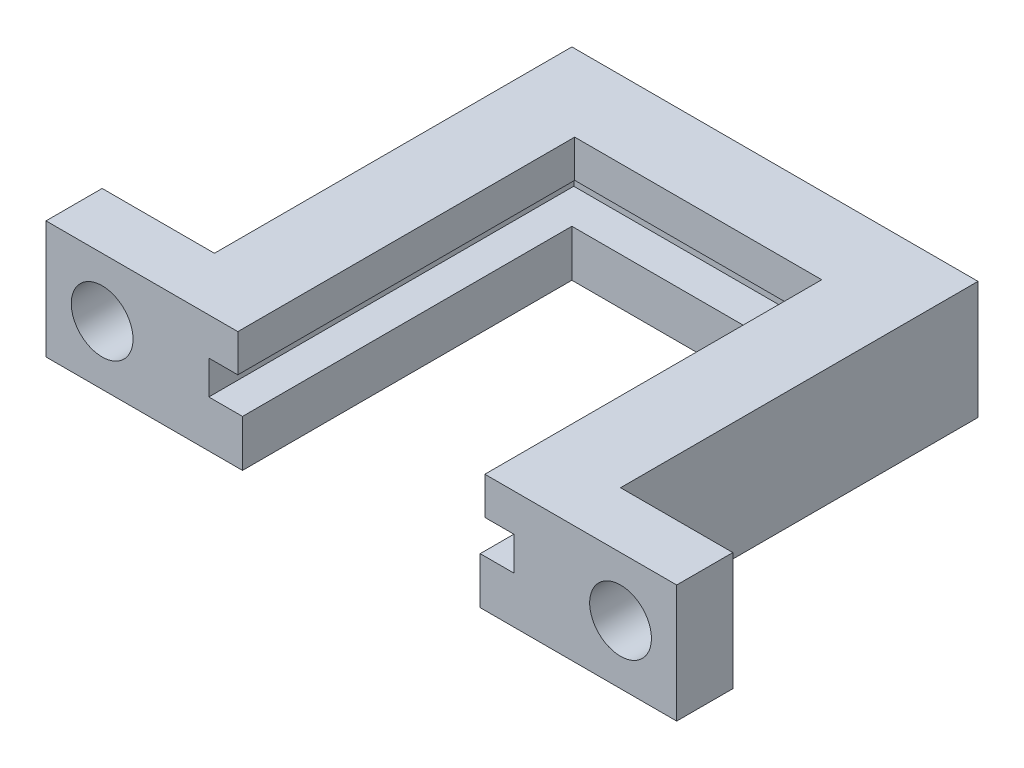
ISO-10303-21;
HEADER;
FILE_DESCRIPTION(('STEP AP214'),'2;1');
FILE_NAME('part.step','',(''),(''),'','','');
FILE_SCHEMA(('AUTOMOTIVE_DESIGN { 1 0 10303 214 1 1 1 1 }'));
ENDSEC;
DATA;
#1=APPLICATION_CONTEXT('core data for automotive mechanical design processes');
#2=APPLICATION_PROTOCOL_DEFINITION('international standard','automotive_design',2000,#1);
#3=PRODUCT_CONTEXT('',#1,'mechanical');
#4=PRODUCT('Part','Part','',(#3));
#5=PRODUCT_RELATED_PRODUCT_CATEGORY('part','',(#4));
#6=PRODUCT_DEFINITION_FORMATION('','',#4);
#7=PRODUCT_DEFINITION_CONTEXT('part definition',#1,'design');
#8=PRODUCT_DEFINITION('design','',#6,#7);
#9=PRODUCT_DEFINITION_SHAPE('','',#8);
#10=(LENGTH_UNIT() NAMED_UNIT(*) SI_UNIT(.MILLI.,.METRE.));
#11=(NAMED_UNIT(*) PLANE_ANGLE_UNIT() SI_UNIT($,.RADIAN.));
#12=(NAMED_UNIT(*) SI_UNIT($,.STERADIAN.) SOLID_ANGLE_UNIT());
#13=UNCERTAINTY_MEASURE_WITH_UNIT(LENGTH_MEASURE(1.E-05),#10,'distance_accuracy_value','');
#14=(GEOMETRIC_REPRESENTATION_CONTEXT(3) GLOBAL_UNCERTAINTY_ASSIGNED_CONTEXT((#13)) GLOBAL_UNIT_ASSIGNED_CONTEXT((#10,
#11,#12)) REPRESENTATION_CONTEXT('',''));
#15=CARTESIAN_POINT('',(0.,0.,0.));
#16=DIRECTION('',(0.,0.,1.));
#17=DIRECTION('',(1.,0.,0.));
#18=AXIS2_PLACEMENT_3D('',#15,#16,#17);
#19=CARTESIAN_POINT('',(0.,2.5,0.));
#20=DIRECTION('',(0.,-1.,0.));
#21=DIRECTION('',(0.,0.,-1.));
#22=AXIS2_PLACEMENT_3D('',#19,#20,#21);
#23=PLANE('',#22);
#24=DIRECTION('',(0.,0.,1.));
#25=VECTOR('',#24,1.);
#26=CARTESIAN_POINT('',(19.,2.5,0.));
#27=LINE('',#26,#25);
#28=CARTESIAN_POINT('',(19.,2.5,-19.5));
#29=VERTEX_POINT('',#28);
#30=CARTESIAN_POINT('',(19.,2.5,0.));
#31=VERTEX_POINT('',#30);
#32=EDGE_CURVE('E276',#29,#31,#27,.T.);
#33=ORIENTED_EDGE('',*,*,#32,.F.);
#34=DIRECTION('',(1.,0.,0.));
#35=VECTOR('',#34,1.);
#36=CARTESIAN_POINT('',(19.,2.5,-19.5));
#37=LINE('',#36,#35);
#38=CARTESIAN_POINT('',(2.7,2.5,-19.5));
#39=VERTEX_POINT('',#38);
#40=EDGE_CURVE('E285',#39,#29,#37,.T.);
#41=ORIENTED_EDGE('',*,*,#40,.F.);
#42=DIRECTION('',(0.,0.,-1.));
#43=VECTOR('',#42,1.);
#44=CARTESIAN_POINT('',(2.7,2.5,-19.5));
#45=LINE('',#44,#43);
#46=CARTESIAN_POINT('',(2.7,2.5,0.));
#47=VERTEX_POINT('',#46);
#48=EDGE_CURVE('E271',#47,#39,#45,.T.);
#49=ORIENTED_EDGE('',*,*,#48,.F.);
#50=DIRECTION('',(1.,0.,0.));
#51=VECTOR('',#50,1.);
#52=CARTESIAN_POINT('',(4.5,2.5,0.));
#53=LINE('',#52,#51);
#54=CARTESIAN_POINT('',(4.5,2.5,0.));
#55=VERTEX_POINT('',#54);
#56=EDGE_CURVE('E302',#47,#55,#53,.T.);
#57=ORIENTED_EDGE('',*,*,#56,.T.);
#58=DIRECTION('',(0.,0.,-1.));
#59=VECTOR('',#58,1.);
#60=CARTESIAN_POINT('',(4.5,2.5,-17.6));
#61=LINE('',#60,#59);
#62=CARTESIAN_POINT('',(4.5,2.5,-17.6));
#63=VERTEX_POINT('',#62);
#64=EDGE_CURVE('E304',#55,#63,#61,.T.);
#65=ORIENTED_EDGE('',*,*,#64,.T.);
#66=DIRECTION('',(1.,0.,0.));
#67=VECTOR('',#66,1.);
#68=CARTESIAN_POINT('',(17.2,2.5,-17.6));
#69=LINE('',#68,#67);
#70=CARTESIAN_POINT('',(17.2,2.5,-17.6));
#71=VERTEX_POINT('',#70);
#72=EDGE_CURVE('E307',#63,#71,#69,.T.);
#73=ORIENTED_EDGE('',*,*,#72,.T.);
#74=DIRECTION('',(0.,0.,1.));
#75=VECTOR('',#74,1.);
#76=CARTESIAN_POINT('',(17.2,2.5,0.));
#77=LINE('',#76,#75);
#78=CARTESIAN_POINT('',(17.2,2.5,0.));
#79=VERTEX_POINT('',#78);
#80=EDGE_CURVE('E309',#71,#79,#77,.T.);
#81=ORIENTED_EDGE('',*,*,#80,.T.);
#82=DIRECTION('',(1.,0.,0.));
#83=VECTOR('',#82,1.);
#84=CARTESIAN_POINT('',(21.7,2.5,0.));
#85=LINE('',#84,#83);
#86=EDGE_CURVE('E311',#79,#31,#85,.T.);
#87=ORIENTED_EDGE('',*,*,#86,.T.);
#88=EDGE_LOOP('',(#33,#41,#49,#57,#65,#73,#81,#87));
#89=FACE_BOUND('',#88,.T.);
#90=ADVANCED_FACE('F37',(#89),#23,.F.);
#91=CARTESIAN_POINT('',(4.5,2.5,0.));
#92=DIRECTION('',(0.,0.,-1.));
#93=DIRECTION('',(-1.,0.,0.));
#94=AXIS2_PLACEMENT_3D('',#91,#92,#93);
#95=PLANE('',#94);
#96=DIRECTION('',(1.,0.,0.));
#97=VECTOR('',#96,1.);
#98=CARTESIAN_POINT('',(4.5,0.,0.));
#99=LINE('',#98,#97);
#100=CARTESIAN_POINT('',(-6.,0.,0.));
#101=VERTEX_POINT('',#100);
#102=CARTESIAN_POINT('',(4.5,0.,0.));
#103=VERTEX_POINT('',#102);
#104=EDGE_CURVE('E301',#101,#103,#99,.T.);
#105=ORIENTED_EDGE('',*,*,#104,.T.);
#106=DIRECTION('',(0.,-1.,0.));
#107=VECTOR('',#106,1.);
#108=CARTESIAN_POINT('',(4.5,2.5,0.));
#109=LINE('',#108,#107);
#110=EDGE_CURVE('E11',#55,#103,#109,.T.);
#111=ORIENTED_EDGE('',*,*,#110,.F.);
#112=ORIENTED_EDGE('',*,*,#56,.F.);
#113=DIRECTION('',(0.,-1.,0.));
#114=VECTOR('',#113,1.);
#115=CARTESIAN_POINT('',(2.7,4.3,0.));
#116=LINE('',#115,#114);
#117=CARTESIAN_POINT('',(2.7,4.3,0.));
#118=VERTEX_POINT('',#117);
#119=EDGE_CURVE('E298',#118,#47,#116,.T.);
#120=ORIENTED_EDGE('',*,*,#119,.F.);
#121=DIRECTION('',(1.,0.,0.));
#122=VECTOR('',#121,1.);
#123=CARTESIAN_POINT('',(4.25,4.3,0.));
#124=LINE('',#123,#122);
#125=CARTESIAN_POINT('',(4.25,4.3,0.));
#126=VERTEX_POINT('',#125);
#127=EDGE_CURVE('E227',#118,#126,#124,.T.);
#128=ORIENTED_EDGE('',*,*,#127,.T.);
#129=DIRECTION('',(0.,-1.,0.));
#130=VECTOR('',#129,1.);
#131=CARTESIAN_POINT('',(4.25,6.3,0.));
#132=LINE('',#131,#130);
#133=CARTESIAN_POINT('',(4.25,6.3,0.));
#134=VERTEX_POINT('',#133);
#135=EDGE_CURVE('E268',#134,#126,#132,.T.);
#136=ORIENTED_EDGE('',*,*,#135,.F.);
#137=DIRECTION('',(1.,0.,0.));
#138=VECTOR('',#137,1.);
#139=CARTESIAN_POINT('',(4.25,6.3,0.));
#140=LINE('',#139,#138);
#141=CARTESIAN_POINT('',(-6.,6.3,0.));
#142=VERTEX_POINT('',#141);
#143=EDGE_CURVE('E230',#142,#134,#140,.T.);
#144=ORIENTED_EDGE('',*,*,#143,.F.);
#145=DIRECTION('',(0.,-1.,0.));
#146=VECTOR('',#145,1.);
#147=CARTESIAN_POINT('',(-6.,0.,0.));
#148=LINE('',#147,#146);
#149=EDGE_CURVE('E209',#142,#101,#148,.T.);
#150=ORIENTED_EDGE('',*,*,#149,.T.);
#151=EDGE_LOOP('',(#105,#111,#112,#120,#128,#136,#144,#150));
#152=FACE_BOUND('',#151,.T.);
#153=CARTESIAN_POINT('',(-3.,3.15,0.));
#154=DIRECTION('',(0.,0.,1.));
#155=DIRECTION('',(1.,0.,0.));
#156=AXIS2_PLACEMENT_3D('',#153,#154,#155);
#157=CIRCLE('',#156,1.65);
#158=CARTESIAN_POINT('',(-1.35,3.15,0.));
#159=VERTEX_POINT('',#158);
#160=EDGE_CURVE('E204',#159,#159,#157,.T.);
#161=ORIENTED_EDGE('',*,*,#160,.F.);
#162=EDGE_LOOP('',(#161));
#163=FACE_BOUND('',#162,.T.);
#164=ADVANCED_FACE('F39',(#152,#163),#95,.F.);
#165=CARTESIAN_POINT('',(4.5,2.5,-17.6));
#166=DIRECTION('',(-1.,0.,0.));
#167=DIRECTION('',(0.,0.,1.));
#168=AXIS2_PLACEMENT_3D('',#165,#166,#167);
#169=PLANE('',#168);
#170=DIRECTION('',(0.,0.,-1.));
#171=VECTOR('',#170,1.);
#172=CARTESIAN_POINT('',(4.5,0.,-17.6));
#173=LINE('',#172,#171);
#174=CARTESIAN_POINT('',(4.5,0.,-17.6));
#175=VERTEX_POINT('',#174);
#176=EDGE_CURVE('E316',#103,#175,#173,.T.);
#177=ORIENTED_EDGE('',*,*,#176,.T.);
#178=DIRECTION('',(0.,-1.,0.));
#179=VECTOR('',#178,1.);
#180=CARTESIAN_POINT('',(4.5,2.5,-17.6));
#181=LINE('',#180,#179);
#182=EDGE_CURVE('E45',#63,#175,#181,.T.);
#183=ORIENTED_EDGE('',*,*,#182,.F.);
#184=ORIENTED_EDGE('',*,*,#64,.F.);
#185=ORIENTED_EDGE('',*,*,#110,.T.);
#186=EDGE_LOOP('',(#177,#183,#184,#185));
#187=FACE_BOUND('',#186,.T.);
#188=ADVANCED_FACE('F388',(#187),#169,.F.);
#189=CARTESIAN_POINT('',(17.2,2.5,-17.6));
#190=DIRECTION('',(0.,0.,-1.));
#191=DIRECTION('',(-1.,0.,0.));
#192=AXIS2_PLACEMENT_3D('',#189,#190,#191);
#193=PLANE('',#192);
#194=DIRECTION('',(1.,0.,0.));
#195=VECTOR('',#194,1.);
#196=CARTESIAN_POINT('',(17.2,0.,-17.6));
#197=LINE('',#196,#195);
#198=CARTESIAN_POINT('',(17.2,0.,-17.6));
#199=VERTEX_POINT('',#198);
#200=EDGE_CURVE('E318',#175,#199,#197,.T.);
#201=ORIENTED_EDGE('',*,*,#200,.T.);
#202=DIRECTION('',(0.,-1.,0.));
#203=VECTOR('',#202,1.);
#204=CARTESIAN_POINT('',(17.2,2.5,-17.6));
#205=LINE('',#204,#203);
#206=EDGE_CURVE('E337',#71,#199,#205,.T.);
#207=ORIENTED_EDGE('',*,*,#206,.F.);
#208=ORIENTED_EDGE('',*,*,#72,.F.);
#209=ORIENTED_EDGE('',*,*,#182,.T.);
#210=EDGE_LOOP('',(#201,#207,#208,#209));
#211=FACE_BOUND('',#210,.T.);
#212=ADVANCED_FACE('F344',(#211),#193,.F.);
#213=CARTESIAN_POINT('',(17.2,2.5,0.));
#214=DIRECTION('',(1.,0.,0.));
#215=DIRECTION('',(0.,0.,-1.));
#216=AXIS2_PLACEMENT_3D('',#213,#214,#215);
#217=PLANE('',#216);
#218=DIRECTION('',(0.,0.,1.));
#219=VECTOR('',#218,1.);
#220=CARTESIAN_POINT('',(17.2,0.,0.));
#221=LINE('',#220,#219);
#222=CARTESIAN_POINT('',(17.2,0.,0.));
#223=VERTEX_POINT('',#222);
#224=EDGE_CURVE('E320',#199,#223,#221,.T.);
#225=ORIENTED_EDGE('',*,*,#224,.T.);
#226=DIRECTION('',(0.,-1.,0.));
#227=VECTOR('',#226,1.);
#228=CARTESIAN_POINT('',(17.2,2.5,0.));
#229=LINE('',#228,#227);
#230=EDGE_CURVE('E334',#79,#223,#229,.T.);
#231=ORIENTED_EDGE('',*,*,#230,.F.);
#232=ORIENTED_EDGE('',*,*,#80,.F.);
#233=ORIENTED_EDGE('',*,*,#206,.T.);
#234=EDGE_LOOP('',(#225,#231,#232,#233));
#235=FACE_BOUND('',#234,.T.);
#236=ADVANCED_FACE('F351',(#235),#217,.F.);
#237=CARTESIAN_POINT('',(21.7,2.5,0.));
#238=DIRECTION('',(0.,0.,-1.));
#239=DIRECTION('',(-1.,0.,0.));
#240=AXIS2_PLACEMENT_3D('',#237,#238,#239);
#241=PLANE('',#240);
#242=DIRECTION('',(1.,0.,0.));
#243=VECTOR('',#242,1.);
#244=CARTESIAN_POINT('',(21.7,0.,0.));
#245=LINE('',#244,#243);
#246=CARTESIAN_POINT('',(27.7,0.,0.));
#247=VERTEX_POINT('',#246);
#248=EDGE_CURVE('E322',#223,#247,#245,.T.);
#249=ORIENTED_EDGE('',*,*,#248,.T.);
#250=DIRECTION('',(0.,1.,0.));
#251=VECTOR('',#250,1.);
#252=CARTESIAN_POINT('',(27.7,0.,0.));
#253=LINE('',#252,#251);
#254=CARTESIAN_POINT('',(27.7,6.3,0.));
#255=VERTEX_POINT('',#254);
#256=EDGE_CURVE('E183',#247,#255,#253,.T.);
#257=ORIENTED_EDGE('',*,*,#256,.T.);
#258=DIRECTION('',(1.,0.,0.));
#259=VECTOR('',#258,1.);
#260=CARTESIAN_POINT('',(21.7,6.3,0.));
#261=LINE('',#260,#259);
#262=CARTESIAN_POINT('',(17.45,6.3,0.));
#263=VERTEX_POINT('',#262);
#264=EDGE_CURVE('E240',#263,#255,#261,.T.);
#265=ORIENTED_EDGE('',*,*,#264,.F.);
#266=DIRECTION('',(0.,-1.,0.));
#267=VECTOR('',#266,1.);
#268=CARTESIAN_POINT('',(17.45,6.3,0.));
#269=LINE('',#268,#267);
#270=CARTESIAN_POINT('',(17.45,4.3,0.));
#271=VERTEX_POINT('',#270);
#272=EDGE_CURVE('E250',#263,#271,#269,.T.);
#273=ORIENTED_EDGE('',*,*,#272,.T.);
#274=DIRECTION('',(1.,0.,0.));
#275=VECTOR('',#274,1.);
#276=CARTESIAN_POINT('',(21.7,4.3,0.));
#277=LINE('',#276,#275);
#278=CARTESIAN_POINT('',(19.,4.3,0.));
#279=VERTEX_POINT('',#278);
#280=EDGE_CURVE('E234',#271,#279,#277,.T.);
#281=ORIENTED_EDGE('',*,*,#280,.T.);
#282=DIRECTION('',(0.,-1.,0.));
#283=VECTOR('',#282,1.);
#284=CARTESIAN_POINT('',(19.,4.3,0.));
#285=LINE('',#284,#283);
#286=EDGE_CURVE('E282',#279,#31,#285,.T.);
#287=ORIENTED_EDGE('',*,*,#286,.T.);
#288=ORIENTED_EDGE('',*,*,#86,.F.);
#289=ORIENTED_EDGE('',*,*,#230,.T.);
#290=EDGE_LOOP('',(#249,#257,#265,#273,#281,#287,#288,#289));
#291=FACE_BOUND('',#290,.T.);
#292=CARTESIAN_POINT('',(24.7,3.15,0.));
#293=DIRECTION('',(0.,0.,1.));
#294=DIRECTION('',(1.,0.,0.));
#295=AXIS2_PLACEMENT_3D('',#292,#293,#294);
#296=CIRCLE('',#295,1.65);
#297=CARTESIAN_POINT('',(26.35,3.15,0.));
#298=VERTEX_POINT('',#297);
#299=EDGE_CURVE('E592',#298,#298,#296,.T.);
#300=ORIENTED_EDGE('',*,*,#299,.F.);
#301=EDGE_LOOP('',(#300));
#302=FACE_BOUND('',#301,.T.);
#303=ADVANCED_FACE('F355',(#291,#302),#241,.F.);
#304=CARTESIAN_POINT('',(21.7,2.5,-22.1));
#305=DIRECTION('',(-1.,0.,0.));
#306=DIRECTION('',(0.,0.,1.));
#307=AXIS2_PLACEMENT_3D('',#304,#305,#306);
#308=PLANE('',#307);
#309=DIRECTION('',(0.,0.,-1.));
#310=VECTOR('',#309,1.);
#311=CARTESIAN_POINT('',(21.7,6.3,-22.1));
#312=LINE('',#311,#310);
#313=CARTESIAN_POINT('',(21.7,6.3,-3.));
#314=VERTEX_POINT('',#313);
#315=CARTESIAN_POINT('',(21.7,6.3,-22.1));
#316=VERTEX_POINT('',#315);
#317=EDGE_CURVE('E242',#314,#316,#312,.T.);
#318=ORIENTED_EDGE('',*,*,#317,.F.);
#319=DIRECTION('',(0.,-1.,0.));
#320=VECTOR('',#319,1.);
#321=CARTESIAN_POINT('',(21.7,0.,-3.));
#322=LINE('',#321,#320);
#323=CARTESIAN_POINT('',(21.7,0.,-3.));
#324=VERTEX_POINT('',#323);
#325=EDGE_CURVE('E196',#314,#324,#322,.T.);
#326=ORIENTED_EDGE('',*,*,#325,.T.);
#327=DIRECTION('',(0.,0.,-1.));
#328=VECTOR('',#327,1.);
#329=CARTESIAN_POINT('',(21.7,0.,-22.1));
#330=LINE('',#329,#328);
#331=CARTESIAN_POINT('',(21.7,0.,-22.1));
#332=VERTEX_POINT('',#331);
#333=EDGE_CURVE('E195',#324,#332,#330,.T.);
#334=ORIENTED_EDGE('',*,*,#333,.T.);
#335=DIRECTION('',(0.,-1.,0.));
#336=VECTOR('',#335,1.);
#337=CARTESIAN_POINT('',(21.7,2.5,-22.1));
#338=LINE('',#337,#336);
#339=EDGE_CURVE('E331',#316,#332,#338,.T.);
#340=ORIENTED_EDGE('',*,*,#339,.F.);
#341=EDGE_LOOP('',(#318,#326,#334,#340));
#342=FACE_BOUND('',#341,.T.);
#343=ADVANCED_FACE('F412',(#342),#308,.F.);
#344=CARTESIAN_POINT('',(0.,2.5,-22.1));
#345=DIRECTION('',(0.,0.,1.));
#346=DIRECTION('',(1.,0.,0.));
#347=AXIS2_PLACEMENT_3D('',#344,#345,#346);
#348=PLANE('',#347);
#349=DIRECTION('',(-1.,0.,0.));
#350=VECTOR('',#349,1.);
#351=CARTESIAN_POINT('',(0.,0.,-22.1));
#352=LINE('',#351,#350);
#353=CARTESIAN_POINT('',(0.,0.,-22.1));
#354=VERTEX_POINT('',#353);
#355=EDGE_CURVE('E325',#332,#354,#352,.T.);
#356=ORIENTED_EDGE('',*,*,#355,.T.);
#357=DIRECTION('',(0.,-1.,0.));
#358=VECTOR('',#357,1.);
#359=CARTESIAN_POINT('',(0.,2.5,-22.1));
#360=LINE('',#359,#358);
#361=CARTESIAN_POINT('',(0.,6.3,-22.1));
#362=VERTEX_POINT('',#361);
#363=EDGE_CURVE('E313',#362,#354,#360,.T.);
#364=ORIENTED_EDGE('',*,*,#363,.F.);
#365=DIRECTION('',(-1.,0.,0.));
#366=VECTOR('',#365,1.);
#367=CARTESIAN_POINT('',(0.,6.3,-22.1));
#368=LINE('',#367,#366);
#369=EDGE_CURVE('E244',#316,#362,#368,.T.);
#370=ORIENTED_EDGE('',*,*,#369,.F.);
#371=ORIENTED_EDGE('',*,*,#339,.T.);
#372=EDGE_LOOP('',(#356,#364,#370,#371));
#373=FACE_BOUND('',#372,.T.);
#374=ADVANCED_FACE('F409',(#373),#348,.F.);
#375=CARTESIAN_POINT('',(0.,2.5,0.));
#376=DIRECTION('',(1.,0.,0.));
#377=DIRECTION('',(0.,0.,-1.));
#378=AXIS2_PLACEMENT_3D('',#375,#376,#377);
#379=PLANE('',#378);
#380=DIRECTION('',(0.,0.,1.));
#381=VECTOR('',#380,1.);
#382=CARTESIAN_POINT('',(0.,0.,0.));
#383=LINE('',#382,#381);
#384=CARTESIAN_POINT('',(0.,0.,-3.));
#385=VERTEX_POINT('',#384);
#386=EDGE_CURVE('E305',#354,#385,#383,.T.);
#387=ORIENTED_EDGE('',*,*,#386,.T.);
#388=DIRECTION('',(0.,1.,0.));
#389=VECTOR('',#388,1.);
#390=CARTESIAN_POINT('',(0.,0.,-3.));
#391=LINE('',#390,#389);
#392=CARTESIAN_POINT('',(0.,6.3,-3.));
#393=VERTEX_POINT('',#392);
#394=EDGE_CURVE('E212',#385,#393,#391,.T.);
#395=ORIENTED_EDGE('',*,*,#394,.T.);
#396=DIRECTION('',(0.,0.,1.));
#397=VECTOR('',#396,1.);
#398=CARTESIAN_POINT('',(0.,6.3,0.));
#399=LINE('',#398,#397);
#400=EDGE_CURVE('E247',#362,#393,#399,.T.);
#401=ORIENTED_EDGE('',*,*,#400,.F.);
#402=ORIENTED_EDGE('',*,*,#363,.T.);
#403=EDGE_LOOP('',(#387,#395,#401,#402));
#404=FACE_BOUND('',#403,.T.);
#405=ADVANCED_FACE('F406',(#404),#379,.F.);
#406=CARTESIAN_POINT('',(0.,0.,0.));
#407=DIRECTION('',(0.,-1.,0.));
#408=DIRECTION('',(0.,0.,-1.));
#409=AXIS2_PLACEMENT_3D('',#406,#407,#408);
#410=PLANE('',#409);
#411=ORIENTED_EDGE('',*,*,#104,.F.);
#412=DIRECTION('',(0.,0.,1.));
#413=VECTOR('',#412,1.);
#414=CARTESIAN_POINT('',(-6.,0.,-3.));
#415=LINE('',#414,#413);
#416=CARTESIAN_POINT('',(-6.,0.,-3.));
#417=VERTEX_POINT('',#416);
#418=EDGE_CURVE('E224',#417,#101,#415,.T.);
#419=ORIENTED_EDGE('',*,*,#418,.F.);
#420=DIRECTION('',(1.,0.,0.));
#421=VECTOR('',#420,1.);
#422=CARTESIAN_POINT('',(0.,0.,-3.));
#423=LINE('',#422,#421);
#424=EDGE_CURVE('E218',#417,#385,#423,.T.);
#425=ORIENTED_EDGE('',*,*,#424,.T.);
#426=ORIENTED_EDGE('',*,*,#386,.F.);
#427=ORIENTED_EDGE('',*,*,#355,.F.);
#428=ORIENTED_EDGE('',*,*,#333,.F.);
#429=DIRECTION('',(1.,0.,0.));
#430=VECTOR('',#429,1.);
#431=CARTESIAN_POINT('',(21.7,0.,-3.));
#432=LINE('',#431,#430);
#433=CARTESIAN_POINT('',(27.7,0.,-3.));
#434=VERTEX_POINT('',#433);
#435=EDGE_CURVE('E52',#324,#434,#432,.T.);
#436=ORIENTED_EDGE('',*,*,#435,.T.);
#437=DIRECTION('',(0.,0.,1.));
#438=VECTOR('',#437,1.);
#439=CARTESIAN_POINT('',(27.7,0.,-3.));
#440=LINE('',#439,#438);
#441=EDGE_CURVE('E177',#434,#247,#440,.T.);
#442=ORIENTED_EDGE('',*,*,#441,.T.);
#443=ORIENTED_EDGE('',*,*,#248,.F.);
#444=ORIENTED_EDGE('',*,*,#224,.F.);
#445=ORIENTED_EDGE('',*,*,#200,.F.);
#446=ORIENTED_EDGE('',*,*,#176,.F.);
#447=EDGE_LOOP('',(#411,#419,#425,#426,#427,#428,#436,#442,#443,#444,#445,#446));
#448=FACE_BOUND('',#447,.T.);
#449=ADVANCED_FACE('F193',(#448),#410,.T.);
#450=CARTESIAN_POINT('',(2.7,4.3,-19.5));
#451=DIRECTION('',(-1.,0.,0.));
#452=DIRECTION('',(0.,0.,1.));
#453=AXIS2_PLACEMENT_3D('',#450,#451,#452);
#454=PLANE('',#453);
#455=ORIENTED_EDGE('',*,*,#48,.T.);
#456=DIRECTION('',(0.,-1.,0.));
#457=VECTOR('',#456,1.);
#458=CARTESIAN_POINT('',(2.7,4.3,-19.5));
#459=LINE('',#458,#457);
#460=CARTESIAN_POINT('',(2.7,4.3,-19.5));
#461=VERTEX_POINT('',#460);
#462=EDGE_CURVE('E295',#461,#39,#459,.T.);
#463=ORIENTED_EDGE('',*,*,#462,.F.);
#464=DIRECTION('',(0.,0.,-1.));
#465=VECTOR('',#464,1.);
#466=CARTESIAN_POINT('',(2.7,4.3,-19.5));
#467=LINE('',#466,#465);
#468=EDGE_CURVE('E272',#118,#461,#467,.T.);
#469=ORIENTED_EDGE('',*,*,#468,.F.);
#470=ORIENTED_EDGE('',*,*,#119,.T.);
#471=EDGE_LOOP('',(#455,#463,#469,#470));
#472=FACE_BOUND('',#471,.T.);
#473=ADVANCED_FACE('F366',(#472),#454,.F.);
#474=CARTESIAN_POINT('',(19.,4.3,-19.5));
#475=DIRECTION('',(0.,0.,-1.));
#476=DIRECTION('',(-1.,0.,0.));
#477=AXIS2_PLACEMENT_3D('',#474,#475,#476);
#478=PLANE('',#477);
#479=ORIENTED_EDGE('',*,*,#40,.T.);
#480=DIRECTION('',(0.,-1.,0.));
#481=VECTOR('',#480,1.);
#482=CARTESIAN_POINT('',(19.,4.3,-19.5));
#483=LINE('',#482,#481);
#484=CARTESIAN_POINT('',(19.,4.3,-19.5));
#485=VERTEX_POINT('',#484);
#486=EDGE_CURVE('E292',#485,#29,#483,.T.);
#487=ORIENTED_EDGE('',*,*,#486,.F.);
#488=DIRECTION('',(1.,0.,0.));
#489=VECTOR('',#488,1.);
#490=CARTESIAN_POINT('',(19.,4.3,-19.5));
#491=LINE('',#490,#489);
#492=EDGE_CURVE('E275',#461,#485,#491,.T.);
#493=ORIENTED_EDGE('',*,*,#492,.F.);
#494=ORIENTED_EDGE('',*,*,#462,.T.);
#495=EDGE_LOOP('',(#479,#487,#493,#494));
#496=FACE_BOUND('',#495,.T.);
#497=ADVANCED_FACE('F363',(#496),#478,.F.);
#498=CARTESIAN_POINT('',(19.,4.3,0.));
#499=DIRECTION('',(1.,0.,0.));
#500=DIRECTION('',(0.,0.,-1.));
#501=AXIS2_PLACEMENT_3D('',#498,#499,#500);
#502=PLANE('',#501);
#503=ORIENTED_EDGE('',*,*,#32,.T.);
#504=ORIENTED_EDGE('',*,*,#286,.F.);
#505=DIRECTION('',(0.,0.,1.));
#506=VECTOR('',#505,1.);
#507=CARTESIAN_POINT('',(19.,4.3,0.));
#508=LINE('',#507,#506);
#509=EDGE_CURVE('E279',#485,#279,#508,.T.);
#510=ORIENTED_EDGE('',*,*,#509,.F.);
#511=ORIENTED_EDGE('',*,*,#486,.T.);
#512=EDGE_LOOP('',(#503,#504,#510,#511));
#513=FACE_BOUND('',#512,.T.);
#514=ADVANCED_FACE('F359',(#513),#502,.F.);
#515=CARTESIAN_POINT('',(4.25,6.3,-18.));
#516=DIRECTION('',(-1.,0.,0.));
#517=DIRECTION('',(0.,0.,1.));
#518=AXIS2_PLACEMENT_3D('',#515,#516,#517);
#519=PLANE('',#518);
#520=DIRECTION('',(0.,0.,-1.));
#521=VECTOR('',#520,1.);
#522=CARTESIAN_POINT('',(4.25,4.3,-18.));
#523=LINE('',#522,#521);
#524=CARTESIAN_POINT('',(4.25,4.3,-18.));
#525=VERTEX_POINT('',#524);
#526=EDGE_CURVE('E252',#126,#525,#523,.T.);
#527=ORIENTED_EDGE('',*,*,#526,.T.);
#528=DIRECTION('',(0.,-1.,0.));
#529=VECTOR('',#528,1.);
#530=CARTESIAN_POINT('',(4.25,6.3,-18.));
#531=LINE('',#530,#529);
#532=CARTESIAN_POINT('',(4.25,6.3,-18.));
#533=VERTEX_POINT('',#532);
#534=EDGE_CURVE('E265',#533,#525,#531,.T.);
#535=ORIENTED_EDGE('',*,*,#534,.F.);
#536=DIRECTION('',(0.,0.,-1.));
#537=VECTOR('',#536,1.);
#538=CARTESIAN_POINT('',(4.25,6.3,-18.));
#539=LINE('',#538,#537);
#540=EDGE_CURVE('E233',#134,#533,#539,.T.);
#541=ORIENTED_EDGE('',*,*,#540,.F.);
#542=ORIENTED_EDGE('',*,*,#135,.T.);
#543=EDGE_LOOP('',(#527,#535,#541,#542));
#544=FACE_BOUND('',#543,.T.);
#545=ADVANCED_FACE('F380',(#544),#519,.F.);
#546=CARTESIAN_POINT('',(17.45,6.3,-18.));
#547=DIRECTION('',(0.,0.,-1.));
#548=DIRECTION('',(-1.,0.,0.));
#549=AXIS2_PLACEMENT_3D('',#546,#547,#548);
#550=PLANE('',#549);
#551=DIRECTION('',(1.,0.,0.));
#552=VECTOR('',#551,1.);
#553=CARTESIAN_POINT('',(17.45,4.3,-18.));
#554=LINE('',#553,#552);
#555=CARTESIAN_POINT('',(17.45,4.3,-18.));
#556=VERTEX_POINT('',#555);
#557=EDGE_CURVE('E254',#525,#556,#554,.T.);
#558=ORIENTED_EDGE('',*,*,#557,.T.);
#559=DIRECTION('',(0.,-1.,0.));
#560=VECTOR('',#559,1.);
#561=CARTESIAN_POINT('',(17.45,6.3,-18.));
#562=LINE('',#561,#560);
#563=CARTESIAN_POINT('',(17.45,6.3,-18.));
#564=VERTEX_POINT('',#563);
#565=EDGE_CURVE('E262',#564,#556,#562,.T.);
#566=ORIENTED_EDGE('',*,*,#565,.F.);
#567=DIRECTION('',(1.,0.,0.));
#568=VECTOR('',#567,1.);
#569=CARTESIAN_POINT('',(17.45,6.3,-18.));
#570=LINE('',#569,#568);
#571=EDGE_CURVE('E236',#533,#564,#570,.T.);
#572=ORIENTED_EDGE('',*,*,#571,.F.);
#573=ORIENTED_EDGE('',*,*,#534,.T.);
#574=EDGE_LOOP('',(#558,#566,#572,#573));
#575=FACE_BOUND('',#574,.T.);
#576=ADVANCED_FACE('F499',(#575),#550,.F.);
#577=CARTESIAN_POINT('',(17.45,6.3,0.));
#578=DIRECTION('',(1.,0.,0.));
#579=DIRECTION('',(0.,0.,-1.));
#580=AXIS2_PLACEMENT_3D('',#577,#578,#579);
#581=PLANE('',#580);
#582=DIRECTION('',(0.,0.,1.));
#583=VECTOR('',#582,1.);
#584=CARTESIAN_POINT('',(17.45,4.3,0.));
#585=LINE('',#584,#583);
#586=EDGE_CURVE('E256',#556,#271,#585,.T.);
#587=ORIENTED_EDGE('',*,*,#586,.T.);
#588=ORIENTED_EDGE('',*,*,#272,.F.);
#589=DIRECTION('',(0.,0.,1.));
#590=VECTOR('',#589,1.);
#591=CARTESIAN_POINT('',(17.45,6.3,0.));
#592=LINE('',#591,#590);
#593=EDGE_CURVE('E238',#564,#263,#592,.T.);
#594=ORIENTED_EDGE('',*,*,#593,.F.);
#595=ORIENTED_EDGE('',*,*,#565,.T.);
#596=EDGE_LOOP('',(#587,#588,#594,#595));
#597=FACE_BOUND('',#596,.T.);
#598=ADVANCED_FACE('F506',(#597),#581,.F.);
#599=CARTESIAN_POINT('',(0.,6.3,0.));
#600=DIRECTION('',(0.,-1.,0.));
#601=DIRECTION('',(0.,0.,-1.));
#602=AXIS2_PLACEMENT_3D('',#599,#600,#601);
#603=PLANE('',#602);
#604=ORIENTED_EDGE('',*,*,#143,.T.);
#605=ORIENTED_EDGE('',*,*,#540,.T.);
#606=ORIENTED_EDGE('',*,*,#571,.T.);
#607=ORIENTED_EDGE('',*,*,#593,.T.);
#608=ORIENTED_EDGE('',*,*,#264,.T.);
#609=DIRECTION('',(0.,0.,1.));
#610=VECTOR('',#609,1.);
#611=CARTESIAN_POINT('',(27.7,6.3,-3.));
#612=LINE('',#611,#610);
#613=CARTESIAN_POINT('',(27.7,6.3,-3.));
#614=VERTEX_POINT('',#613);
#615=EDGE_CURVE('E186',#614,#255,#612,.T.);
#616=ORIENTED_EDGE('',*,*,#615,.F.);
#617=DIRECTION('',(-1.,0.,0.));
#618=VECTOR('',#617,1.);
#619=CARTESIAN_POINT('',(21.7,6.3,-3.));
#620=LINE('',#619,#618);
#621=EDGE_CURVE('E187',#614,#314,#620,.T.);
#622=ORIENTED_EDGE('',*,*,#621,.T.);
#623=ORIENTED_EDGE('',*,*,#317,.T.);
#624=ORIENTED_EDGE('',*,*,#369,.T.);
#625=ORIENTED_EDGE('',*,*,#400,.T.);
#626=DIRECTION('',(-1.,0.,0.));
#627=VECTOR('',#626,1.);
#628=CARTESIAN_POINT('',(0.,6.3,-3.));
#629=LINE('',#628,#627);
#630=CARTESIAN_POINT('',(-6.,6.3,-3.));
#631=VERTEX_POINT('',#630);
#632=EDGE_CURVE('E60',#393,#631,#629,.T.);
#633=ORIENTED_EDGE('',*,*,#632,.T.);
#634=DIRECTION('',(0.,0.,1.));
#635=VECTOR('',#634,1.);
#636=CARTESIAN_POINT('',(-6.,6.3,-3.));
#637=LINE('',#636,#635);
#638=EDGE_CURVE('E221',#631,#142,#637,.T.);
#639=ORIENTED_EDGE('',*,*,#638,.T.);
#640=EDGE_LOOP('',(#604,#605,#606,#607,#608,#616,#622,#623,#624,#625,#633,#639));
#641=FACE_BOUND('',#640,.T.);
#642=ADVANCED_FACE('F383',(#641),#603,.F.);
#643=CARTESIAN_POINT('',(0.,4.3,0.));
#644=DIRECTION('',(0.,-1.,0.));
#645=DIRECTION('',(0.,0.,-1.));
#646=AXIS2_PLACEMENT_3D('',#643,#644,#645);
#647=PLANE('',#646);
#648=ORIENTED_EDGE('',*,*,#127,.F.);
#649=ORIENTED_EDGE('',*,*,#468,.T.);
#650=ORIENTED_EDGE('',*,*,#492,.T.);
#651=ORIENTED_EDGE('',*,*,#509,.T.);
#652=ORIENTED_EDGE('',*,*,#280,.F.);
#653=ORIENTED_EDGE('',*,*,#586,.F.);
#654=ORIENTED_EDGE('',*,*,#557,.F.);
#655=ORIENTED_EDGE('',*,*,#526,.F.);
#656=EDGE_LOOP('',(#648,#649,#650,#651,#652,#653,#654,#655));
#657=FACE_BOUND('',#656,.T.);
#658=ADVANCED_FACE('F375',(#657),#647,.T.);
#659=CARTESIAN_POINT('',(-6.,0.,-3.));
#660=DIRECTION('',(-1.,0.,0.));
#661=DIRECTION('',(0.,0.,1.));
#662=AXIS2_PLACEMENT_3D('',#659,#660,#661);
#663=PLANE('',#662);
#664=ORIENTED_EDGE('',*,*,#149,.F.);
#665=ORIENTED_EDGE('',*,*,#638,.F.);
#666=DIRECTION('',(0.,-1.,0.));
#667=VECTOR('',#666,1.);
#668=CARTESIAN_POINT('',(-6.,0.,-3.));
#669=LINE('',#668,#667);
#670=EDGE_CURVE('E215',#631,#417,#669,.T.);
#671=ORIENTED_EDGE('',*,*,#670,.T.);
#672=ORIENTED_EDGE('',*,*,#418,.T.);
#673=EDGE_LOOP('',(#664,#665,#671,#672));
#674=FACE_BOUND('',#673,.T.);
#675=ADVANCED_FACE('F385',(#674),#663,.T.);
#676=CARTESIAN_POINT('',(0.,0.,-3.));
#677=DIRECTION('',(0.,0.,1.));
#678=DIRECTION('',(1.,0.,0.));
#679=AXIS2_PLACEMENT_3D('',#676,#677,#678);
#680=PLANE('',#679);
#681=CARTESIAN_POINT('',(-3.,3.15,-3.));
#682=DIRECTION('',(0.,0.,1.));
#683=DIRECTION('',(1.,0.,0.));
#684=AXIS2_PLACEMENT_3D('',#681,#682,#683);
#685=CIRCLE('',#684,1.65);
#686=CARTESIAN_POINT('',(-1.35,3.15,-3.));
#687=VERTEX_POINT('',#686);
#688=EDGE_CURVE('E206',#687,#687,#685,.T.);
#689=ORIENTED_EDGE('',*,*,#688,.T.);
#690=EDGE_LOOP('',(#689));
#691=FACE_BOUND('',#690,.T.);
#692=ORIENTED_EDGE('',*,*,#394,.F.);
#693=ORIENTED_EDGE('',*,*,#424,.F.);
#694=ORIENTED_EDGE('',*,*,#670,.F.);
#695=ORIENTED_EDGE('',*,*,#632,.F.);
#696=EDGE_LOOP('',(#692,#693,#694,#695));
#697=FACE_BOUND('',#696,.T.);
#698=ADVANCED_FACE('F548',(#691,#697),#680,.F.);
#699=CARTESIAN_POINT('',(-3.,3.15,-3.));
#700=DIRECTION('',(0.,0.,1.));
#701=DIRECTION('',(1.,0.,0.));
#702=AXIS2_PLACEMENT_3D('',#699,#700,#701);
#703=CYLINDRICAL_SURFACE('',#702,1.65);
#704=ORIENTED_EDGE('',*,*,#688,.F.);
#705=EDGE_LOOP('',(#704));
#706=FACE_BOUND('',#705,.T.);
#707=ORIENTED_EDGE('',*,*,#160,.T.);
#708=EDGE_LOOP('',(#707));
#709=FACE_BOUND('',#708,.T.);
#710=ADVANCED_FACE('F555',(#706,#709),#703,.F.);
#711=CARTESIAN_POINT('',(27.7,0.,-3.));
#712=DIRECTION('',(1.,0.,0.));
#713=DIRECTION('',(0.,0.,-1.));
#714=AXIS2_PLACEMENT_3D('',#711,#712,#713);
#715=PLANE('',#714);
#716=ORIENTED_EDGE('',*,*,#256,.F.);
#717=ORIENTED_EDGE('',*,*,#441,.F.);
#718=DIRECTION('',(0.,1.,0.));
#719=VECTOR('',#718,1.);
#720=CARTESIAN_POINT('',(27.7,0.,-3.));
#721=LINE('',#720,#719);
#722=EDGE_CURVE('E180',#434,#614,#721,.T.);
#723=ORIENTED_EDGE('',*,*,#722,.T.);
#724=ORIENTED_EDGE('',*,*,#615,.T.);
#725=EDGE_LOOP('',(#716,#717,#723,#724));
#726=FACE_BOUND('',#725,.T.);
#727=ADVANCED_FACE('F178',(#726),#715,.T.);
#728=CARTESIAN_POINT('',(0.,0.,-3.));
#729=DIRECTION('',(0.,0.,-1.));
#730=DIRECTION('',(-1.,0.,0.));
#731=AXIS2_PLACEMENT_3D('',#728,#729,#730);
#732=PLANE('',#731);
#733=CARTESIAN_POINT('',(24.7,3.15,-3.));
#734=DIRECTION('',(0.,0.,1.));
#735=DIRECTION('',(1.,0.,0.));
#736=AXIS2_PLACEMENT_3D('',#733,#734,#735);
#737=CIRCLE('',#736,1.65);
#738=CARTESIAN_POINT('',(26.35,3.15,-3.));
#739=VERTEX_POINT('',#738);
#740=EDGE_CURVE('E203',#739,#739,#737,.T.);
#741=ORIENTED_EDGE('',*,*,#740,.T.);
#742=EDGE_LOOP('',(#741));
#743=FACE_BOUND('',#742,.T.);
#744=ORIENTED_EDGE('',*,*,#325,.F.);
#745=ORIENTED_EDGE('',*,*,#621,.F.);
#746=ORIENTED_EDGE('',*,*,#722,.F.);
#747=ORIENTED_EDGE('',*,*,#435,.F.);
#748=EDGE_LOOP('',(#744,#745,#746,#747));
#749=FACE_BOUND('',#748,.T.);
#750=ADVANCED_FACE('F189',(#743,#749),#732,.T.);
#751=CARTESIAN_POINT('',(24.7,3.15,-3.));
#752=DIRECTION('',(0.,0.,1.));
#753=DIRECTION('',(1.,0.,0.));
#754=AXIS2_PLACEMENT_3D('',#751,#752,#753);
#755=CYLINDRICAL_SURFACE('',#754,1.65);
#756=ORIENTED_EDGE('',*,*,#740,.F.);
#757=EDGE_LOOP('',(#756));
#758=FACE_BOUND('',#757,.T.);
#759=ORIENTED_EDGE('',*,*,#299,.T.);
#760=EDGE_LOOP('',(#759));
#761=FACE_BOUND('',#760,.T.);
#762=ADVANCED_FACE('F576',(#758,#761),#755,.F.);
#763=CLOSED_SHELL('',(#90,#164,#188,#212,#236,#303,#343,#374,#405,#449,#473,#497,#514,#545,#576,
#598,#642,#658,#675,#698,#710,#727,#750,#762));
#764=MANIFOLD_SOLID_BREP('B2',#763);
#765=ADVANCED_BREP_SHAPE_REPRESENTATION('',(#18,#764),#14);
#766=SHAPE_DEFINITION_REPRESENTATION(#9,#765);
ENDSEC;
END-ISO-10303-21;
